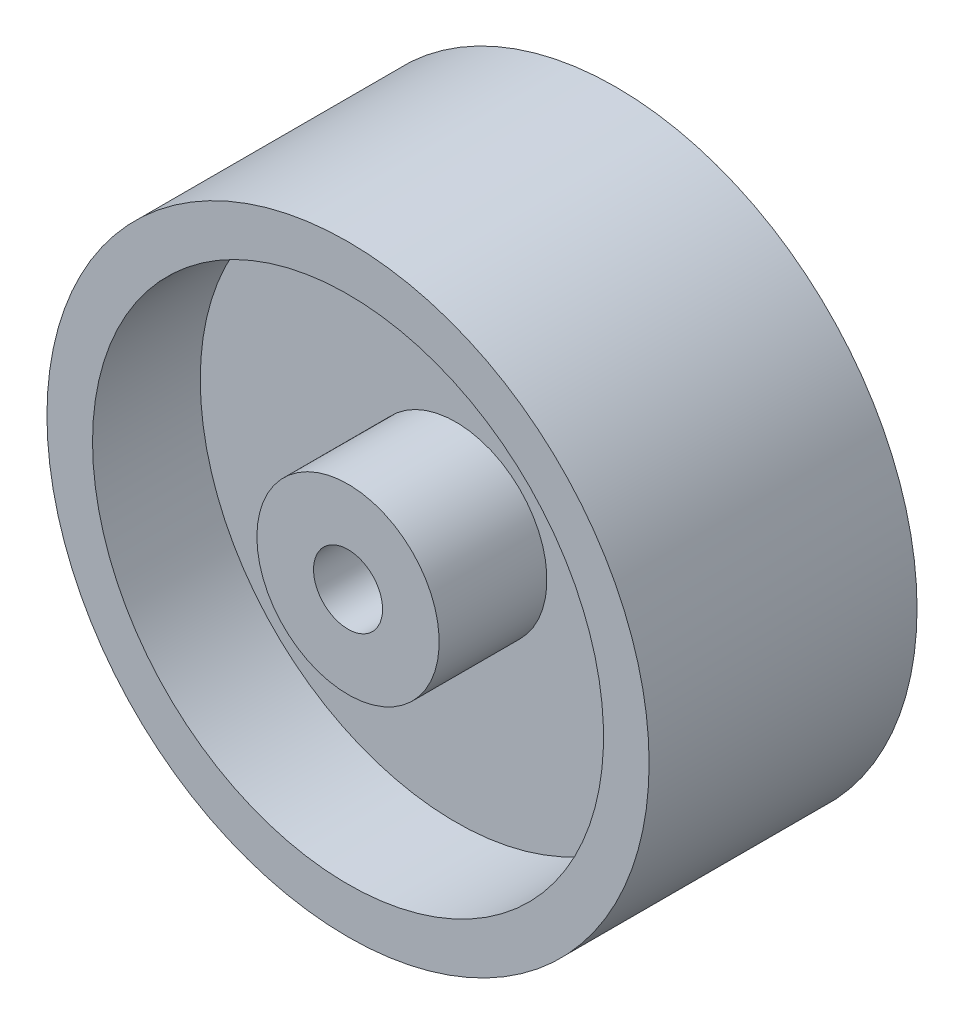
ISO-10303-21;
HEADER;
FILE_DESCRIPTION(('STEP AP214'),'2;1');
FILE_NAME('part.step','',(''),(''),'','','');
FILE_SCHEMA(('AUTOMOTIVE_DESIGN { 1 0 10303 214 1 1 1 1 }'));
ENDSEC;
DATA;
#1=APPLICATION_CONTEXT('core data for automotive mechanical design processes');
#2=APPLICATION_PROTOCOL_DEFINITION('international standard','automotive_design',2000,#1);
#3=PRODUCT_CONTEXT('',#1,'mechanical');
#4=PRODUCT('Part','Part','',(#3));
#5=PRODUCT_RELATED_PRODUCT_CATEGORY('part','',(#4));
#6=PRODUCT_DEFINITION_FORMATION('','',#4);
#7=PRODUCT_DEFINITION_CONTEXT('part definition',#1,'design');
#8=PRODUCT_DEFINITION('design','',#6,#7);
#9=PRODUCT_DEFINITION_SHAPE('','',#8);
#10=(LENGTH_UNIT() NAMED_UNIT(*) SI_UNIT(.MILLI.,.METRE.));
#11=(NAMED_UNIT(*) PLANE_ANGLE_UNIT() SI_UNIT($,.RADIAN.));
#12=(NAMED_UNIT(*) SI_UNIT($,.STERADIAN.) SOLID_ANGLE_UNIT());
#13=UNCERTAINTY_MEASURE_WITH_UNIT(LENGTH_MEASURE(1.E-05),#10,'distance_accuracy_value','');
#14=(GEOMETRIC_REPRESENTATION_CONTEXT(3) GLOBAL_UNCERTAINTY_ASSIGNED_CONTEXT((#13)) GLOBAL_UNIT_ASSIGNED_CONTEXT((#10,
#11,#12)) REPRESENTATION_CONTEXT('',''));
#15=CARTESIAN_POINT('',(0.,0.,0.));
#16=DIRECTION('',(0.,0.,1.));
#17=DIRECTION('',(1.,0.,0.));
#18=AXIS2_PLACEMENT_3D('',#15,#16,#17);
#19=CARTESIAN_POINT('',(0.,0.,-12.319));
#20=DIRECTION('',(0.,0.,1.));
#21=DIRECTION('',(1.,0.,0.));
#22=AXIS2_PLACEMENT_3D('',#19,#20,#21);
#23=PLANE('',#22);
#24=CARTESIAN_POINT('',(0.,0.,-12.319));
#25=DIRECTION('',(0.,0.,-1.));
#26=DIRECTION('',(-1.,0.,0.));
#27=AXIS2_PLACEMENT_3D('',#24,#25,#26);
#28=CIRCLE('',#27,8.382);
#29=CARTESIAN_POINT('',(-8.382,0.,-12.319));
#30=VERTEX_POINT('',#29);
#31=EDGE_CURVE('E61',#30,#30,#28,.T.);
#32=ORIENTED_EDGE('',*,*,#31,.T.);
#33=EDGE_LOOP('',(#32));
#34=FACE_BOUND('',#33,.T.);
#35=CARTESIAN_POINT('',(0.,0.,-12.319));
#36=DIRECTION('',(0.,0.,1.));
#37=DIRECTION('',(1.,0.,0.));
#38=AXIS2_PLACEMENT_3D('',#35,#36,#37);
#39=CIRCLE('',#38,3.175);
#40=CARTESIAN_POINT('',(3.175,0.,-12.319));
#41=VERTEX_POINT('',#40);
#42=EDGE_CURVE('E57',#41,#41,#39,.T.);
#43=ORIENTED_EDGE('',*,*,#42,.T.);
#44=EDGE_LOOP('',(#43));
#45=FACE_BOUND('',#44,.T.);
#46=ADVANCED_FACE('F33',(#34,#45),#23,.F.);
#47=CARTESIAN_POINT('',(0.,0.,12.319));
#48=DIRECTION('',(0.,0.,-1.));
#49=DIRECTION('',(-1.,0.,0.));
#50=AXIS2_PLACEMENT_3D('',#47,#48,#49);
#51=CYLINDRICAL_SURFACE('',#50,27.686);
#52=CARTESIAN_POINT('',(0.,0.,12.319));
#53=DIRECTION('',(0.,0.,1.));
#54=DIRECTION('',(1.,0.,0.));
#55=AXIS2_PLACEMENT_3D('',#52,#53,#54);
#56=CIRCLE('',#55,27.686);
#57=CARTESIAN_POINT('',(27.686,0.,12.319));
#58=VERTEX_POINT('',#57);
#59=EDGE_CURVE('E10',#58,#58,#56,.T.);
#60=ORIENTED_EDGE('',*,*,#59,.F.);
#61=EDGE_LOOP('',(#60));
#62=FACE_BOUND('',#61,.T.);
#63=CARTESIAN_POINT('',(0.,0.,-12.319));
#64=DIRECTION('',(0.,0.,1.));
#65=DIRECTION('',(1.,0.,0.));
#66=AXIS2_PLACEMENT_3D('',#63,#64,#65);
#67=CIRCLE('',#66,27.686);
#68=CARTESIAN_POINT('',(27.686,0.,-12.319));
#69=VERTEX_POINT('',#68);
#70=EDGE_CURVE('E37',#69,#69,#67,.T.);
#71=ORIENTED_EDGE('',*,*,#70,.T.);
#72=EDGE_LOOP('',(#71));
#73=FACE_BOUND('',#72,.T.);
#74=ADVANCED_FACE('F35',(#62,#73),#51,.T.);
#75=CARTESIAN_POINT('',(0.,0.,12.319));
#76=DIRECTION('',(0.,0.,1.));
#77=DIRECTION('',(1.,0.,0.));
#78=AXIS2_PLACEMENT_3D('',#75,#76,#77);
#79=PLANE('',#78);
#80=CARTESIAN_POINT('',(0.,0.,12.319));
#81=DIRECTION('',(0.,0.,-1.));
#82=DIRECTION('',(-1.,0.,0.));
#83=AXIS2_PLACEMENT_3D('',#80,#81,#82);
#84=CIRCLE('',#83,23.495);
#85=CARTESIAN_POINT('',(-23.495,0.,12.319));
#86=VERTEX_POINT('',#85);
#87=EDGE_CURVE('E54',#86,#86,#84,.T.);
#88=ORIENTED_EDGE('',*,*,#87,.T.);
#89=EDGE_LOOP('',(#88));
#90=FACE_BOUND('',#89,.T.);
#91=ORIENTED_EDGE('',*,*,#59,.T.);
#92=EDGE_LOOP('',(#91));
#93=FACE_BOUND('',#92,.T.);
#94=ADVANCED_FACE('F83',(#90,#93),#79,.T.);
#95=CARTESIAN_POINT('',(0.,0.,-12.319));
#96=DIRECTION('',(0.,0.,-1.));
#97=DIRECTION('',(-1.,0.,0.));
#98=AXIS2_PLACEMENT_3D('',#95,#96,#97);
#99=CIRCLE('',#98,23.495);
#100=CARTESIAN_POINT('',(-23.495,0.,-12.319));
#101=VERTEX_POINT('',#100);
#102=EDGE_CURVE('E72',#101,#101,#99,.T.);
#103=ORIENTED_EDGE('',*,*,#102,.F.);
#104=EDGE_LOOP('',(#103));
#105=FACE_BOUND('',#104,.T.);
#106=ORIENTED_EDGE('',*,*,#70,.F.);
#107=EDGE_LOOP('',(#106));
#108=FACE_BOUND('',#107,.T.);
#109=ADVANCED_FACE('F79',(#105,#108),#23,.F.);
#110=CARTESIAN_POINT('',(0.,0.,0.));
#111=DIRECTION('',(0.,0.,-1.));
#112=DIRECTION('',(-1.,0.,0.));
#113=AXIS2_PLACEMENT_3D('',#110,#111,#112);
#114=CYLINDRICAL_SURFACE('',#113,8.382);
#115=CARTESIAN_POINT('',(0.,0.,2.413));
#116=DIRECTION('',(0.,0.,-1.));
#117=DIRECTION('',(-1.,0.,0.));
#118=AXIS2_PLACEMENT_3D('',#115,#116,#117);
#119=CIRCLE('',#118,8.382);
#120=CARTESIAN_POINT('',(-8.382,0.,2.413));
#121=VERTEX_POINT('',#120);
#122=EDGE_CURVE('E48',#121,#121,#119,.T.);
#123=ORIENTED_EDGE('',*,*,#122,.F.);
#124=EDGE_LOOP('',(#123));
#125=FACE_BOUND('',#124,.T.);
#126=CARTESIAN_POINT('',(0.,0.,12.319));
#127=DIRECTION('',(0.,0.,-1.));
#128=DIRECTION('',(-1.,0.,0.));
#129=AXIS2_PLACEMENT_3D('',#126,#127,#128);
#130=CIRCLE('',#129,8.382);
#131=CARTESIAN_POINT('',(-8.382,0.,12.319));
#132=VERTEX_POINT('',#131);
#133=EDGE_CURVE('E44',#132,#132,#130,.T.);
#134=ORIENTED_EDGE('',*,*,#133,.T.);
#135=EDGE_LOOP('',(#134));
#136=FACE_BOUND('',#135,.T.);
#137=ADVANCED_FACE('F82',(#125,#136),#114,.T.);
#138=CARTESIAN_POINT('',(0.,23.495,2.413));
#139=DIRECTION('',(0.,0.,-1.));
#140=DIRECTION('',(-1.,0.,0.));
#141=AXIS2_PLACEMENT_3D('',#138,#139,#140);
#142=PLANE('',#141);
#143=CARTESIAN_POINT('',(0.,0.,2.413));
#144=DIRECTION('',(0.,0.,-1.));
#145=DIRECTION('',(-1.,0.,0.));
#146=AXIS2_PLACEMENT_3D('',#143,#144,#145);
#147=CIRCLE('',#146,23.495);
#148=CARTESIAN_POINT('',(-23.495,0.,2.413));
#149=VERTEX_POINT('',#148);
#150=EDGE_CURVE('E51',#149,#149,#147,.T.);
#151=ORIENTED_EDGE('',*,*,#150,.F.);
#152=EDGE_LOOP('',(#151));
#153=FACE_BOUND('',#152,.T.);
#154=ORIENTED_EDGE('',*,*,#122,.T.);
#155=EDGE_LOOP('',(#154));
#156=FACE_BOUND('',#155,.T.);
#157=ADVANCED_FACE('F102',(#153,#156),#142,.F.);
#158=CARTESIAN_POINT('',(0.,0.,0.));
#159=DIRECTION('',(0.,0.,-1.));
#160=DIRECTION('',(-1.,0.,0.));
#161=AXIS2_PLACEMENT_3D('',#158,#159,#160);
#162=CYLINDRICAL_SURFACE('',#161,23.495);
#163=ORIENTED_EDGE('',*,*,#87,.F.);
#164=EDGE_LOOP('',(#163));
#165=FACE_BOUND('',#164,.T.);
#166=ORIENTED_EDGE('',*,*,#150,.T.);
#167=EDGE_LOOP('',(#166));
#168=FACE_BOUND('',#167,.T.);
#169=ADVANCED_FACE('F106',(#165,#168),#162,.F.);
#170=CARTESIAN_POINT('',(0.,0.,12.319));
#171=DIRECTION('',(0.,0.,1.));
#172=DIRECTION('',(1.,0.,0.));
#173=AXIS2_PLACEMENT_3D('',#170,#171,#172);
#174=CIRCLE('',#173,3.175);
#175=CARTESIAN_POINT('',(3.175,0.,12.319));
#176=VERTEX_POINT('',#175);
#177=EDGE_CURVE('E58',#176,#176,#174,.T.);
#178=ORIENTED_EDGE('',*,*,#177,.F.);
#179=EDGE_LOOP('',(#178));
#180=FACE_BOUND('',#179,.T.);
#181=ORIENTED_EDGE('',*,*,#133,.F.);
#182=EDGE_LOOP('',(#181));
#183=FACE_BOUND('',#182,.T.);
#184=ADVANCED_FACE('F94',(#180,#183),#79,.T.);
#185=CARTESIAN_POINT('',(0.,0.,-12.319));
#186=DIRECTION('',(0.,0.,1.));
#187=DIRECTION('',(1.,0.,0.));
#188=AXIS2_PLACEMENT_3D('',#185,#186,#187);
#189=CYLINDRICAL_SURFACE('',#188,3.175);
#190=ORIENTED_EDGE('',*,*,#42,.F.);
#191=EDGE_LOOP('',(#190));
#192=FACE_BOUND('',#191,.T.);
#193=ORIENTED_EDGE('',*,*,#177,.T.);
#194=EDGE_LOOP('',(#193));
#195=FACE_BOUND('',#194,.T.);
#196=ADVANCED_FACE('F111',(#192,#195),#189,.F.);
#197=CARTESIAN_POINT('',(0.,0.,0.));
#198=DIRECTION('',(0.,0.,1.));
#199=DIRECTION('',(-1.,0.,0.));
#200=AXIS2_PLACEMENT_3D('',#197,#198,#199);
#201=CYLINDRICAL_SURFACE('',#200,8.382);
#202=CARTESIAN_POINT('',(0.,0.,-2.413));
#203=DIRECTION('',(0.,0.,-1.));
#204=DIRECTION('',(-1.,0.,0.));
#205=AXIS2_PLACEMENT_3D('',#202,#203,#204);
#206=CIRCLE('',#205,8.382);
#207=CARTESIAN_POINT('',(-8.382,0.,-2.413));
#208=VERTEX_POINT('',#207);
#209=EDGE_CURVE('E66',#208,#208,#206,.T.);
#210=ORIENTED_EDGE('',*,*,#209,.T.);
#211=EDGE_LOOP('',(#210));
#212=FACE_BOUND('',#211,.T.);
#213=ORIENTED_EDGE('',*,*,#31,.F.);
#214=EDGE_LOOP('',(#213));
#215=FACE_BOUND('',#214,.T.);
#216=ADVANCED_FACE('F114',(#212,#215),#201,.T.);
#217=CARTESIAN_POINT('',(0.,23.495,-2.413));
#218=DIRECTION('',(0.,0.,1.));
#219=DIRECTION('',(-1.,0.,0.));
#220=AXIS2_PLACEMENT_3D('',#217,#218,#219);
#221=PLANE('',#220);
#222=CARTESIAN_POINT('',(0.,0.,-2.413));
#223=DIRECTION('',(0.,0.,-1.));
#224=DIRECTION('',(-1.,0.,0.));
#225=AXIS2_PLACEMENT_3D('',#222,#223,#224);
#226=CIRCLE('',#225,23.495);
#227=CARTESIAN_POINT('',(-23.495,0.,-2.413));
#228=VERTEX_POINT('',#227);
#229=EDGE_CURVE('E69',#228,#228,#226,.T.);
#230=ORIENTED_EDGE('',*,*,#229,.T.);
#231=EDGE_LOOP('',(#230));
#232=FACE_BOUND('',#231,.T.);
#233=ORIENTED_EDGE('',*,*,#209,.F.);
#234=EDGE_LOOP('',(#233));
#235=FACE_BOUND('',#234,.T.);
#236=ADVANCED_FACE('F118',(#232,#235),#221,.F.);
#237=CARTESIAN_POINT('',(0.,0.,0.));
#238=DIRECTION('',(0.,0.,1.));
#239=DIRECTION('',(-1.,0.,0.));
#240=AXIS2_PLACEMENT_3D('',#237,#238,#239);
#241=CYLINDRICAL_SURFACE('',#240,23.495);
#242=ORIENTED_EDGE('',*,*,#102,.T.);
#243=EDGE_LOOP('',(#242));
#244=FACE_BOUND('',#243,.T.);
#245=ORIENTED_EDGE('',*,*,#229,.F.);
#246=EDGE_LOOP('',(#245));
#247=FACE_BOUND('',#246,.T.);
#248=ADVANCED_FACE('F76',(#244,#247),#241,.F.);
#249=CLOSED_SHELL('',(#46,#74,#94,#109,#137,#157,#169,#184,#196,#216,#236,#248));
#250=MANIFOLD_SOLID_BREP('B2',#249);
#251=ADVANCED_BREP_SHAPE_REPRESENTATION('',(#18,#250),#14);
#252=SHAPE_DEFINITION_REPRESENTATION(#9,#251);
ENDSEC;
END-ISO-10303-21;
